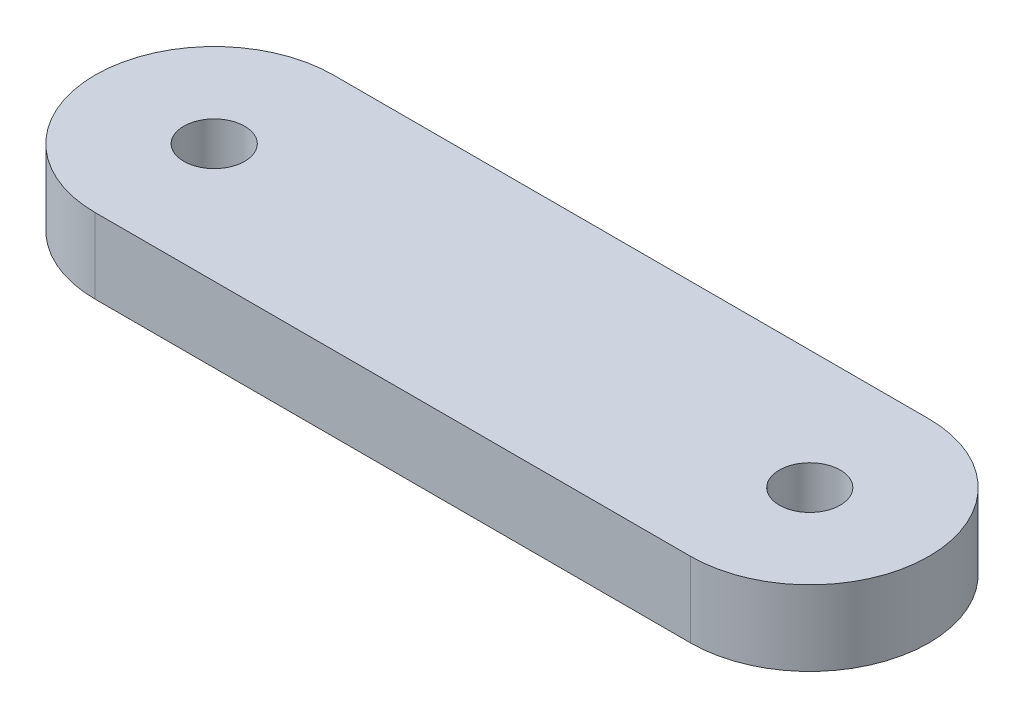
ISO-10303-21;
HEADER;
FILE_DESCRIPTION(('STEP AP214'),'2;1');
FILE_NAME('part.step','',(''),(''),'','','');
FILE_SCHEMA(('AUTOMOTIVE_DESIGN { 1 0 10303 214 1 1 1 1 }'));
ENDSEC;
DATA;
#1=APPLICATION_CONTEXT('core data for automotive mechanical design processes');
#2=APPLICATION_PROTOCOL_DEFINITION('international standard','automotive_design',2000,#1);
#3=PRODUCT_CONTEXT('',#1,'mechanical');
#4=PRODUCT('Part','Part','',(#3));
#5=PRODUCT_RELATED_PRODUCT_CATEGORY('part','',(#4));
#6=PRODUCT_DEFINITION_FORMATION('','',#4);
#7=PRODUCT_DEFINITION_CONTEXT('part definition',#1,'design');
#8=PRODUCT_DEFINITION('design','',#6,#7);
#9=PRODUCT_DEFINITION_SHAPE('','',#8);
#10=(LENGTH_UNIT() NAMED_UNIT(*) SI_UNIT(.MILLI.,.METRE.));
#11=(NAMED_UNIT(*) PLANE_ANGLE_UNIT() SI_UNIT($,.RADIAN.));
#12=(NAMED_UNIT(*) SI_UNIT($,.STERADIAN.) SOLID_ANGLE_UNIT());
#13=UNCERTAINTY_MEASURE_WITH_UNIT(LENGTH_MEASURE(1.E-05),#10,'distance_accuracy_value','');
#14=(GEOMETRIC_REPRESENTATION_CONTEXT(3) GLOBAL_UNCERTAINTY_ASSIGNED_CONTEXT((#13)) GLOBAL_UNIT_ASSIGNED_CONTEXT((#10,
#11,#12)) REPRESENTATION_CONTEXT('',''));
#15=CARTESIAN_POINT('',(0.,0.,0.));
#16=DIRECTION('',(0.,0.,1.));
#17=DIRECTION('',(1.,0.,0.));
#18=AXIS2_PLACEMENT_3D('',#15,#16,#17);
#19=CARTESIAN_POINT('',(13.1315533980582,4.,0.));
#20=DIRECTION('',(0.,1.,0.));
#21=DIRECTION('',(0.,0.,1.));
#22=AXIS2_PLACEMENT_3D('',#19,#20,#21);
#23=PLANE('',#22);
#24=CARTESIAN_POINT('',(-18.6184466019417,4.,0.));
#25=DIRECTION('',(0.,1.,0.));
#26=DIRECTION('',(0.,0.,1.));
#27=AXIS2_PLACEMENT_3D('',#24,#25,#26);
#28=CIRCLE('',#27,1.625);
#29=CARTESIAN_POINT('',(-18.6184466019417,4.,1.625));
#30=VERTEX_POINT('',#29);
#31=EDGE_CURVE('E108',#30,#30,#28,.T.);
#32=ORIENTED_EDGE('',*,*,#31,.F.);
#33=EDGE_LOOP('',(#32));
#34=FACE_BOUND('',#33,.T.);
#35=CARTESIAN_POINT('',(13.1315533980582,4.,0.));
#36=DIRECTION('',(0.,1.,0.));
#37=DIRECTION('',(0.,0.,1.));
#38=AXIS2_PLACEMENT_3D('',#35,#36,#37);
#39=CIRCLE('',#38,6.35);
#40=CARTESIAN_POINT('',(13.1315533980582,4.,6.35));
#41=VERTEX_POINT('',#40);
#42=CARTESIAN_POINT('',(13.1315533980582,4.,-6.35));
#43=VERTEX_POINT('',#42);
#44=EDGE_CURVE('E92',#41,#43,#39,.T.);
#45=ORIENTED_EDGE('',*,*,#44,.T.);
#46=DIRECTION('',(-1.,0.,0.));
#47=VECTOR('',#46,1.);
#48=CARTESIAN_POINT('',(-18.6184466019417,4.,-6.35));
#49=LINE('',#48,#47);
#50=CARTESIAN_POINT('',(-18.6184466019417,4.,-6.35));
#51=VERTEX_POINT('',#50);
#52=EDGE_CURVE('E87',#43,#51,#49,.T.);
#53=ORIENTED_EDGE('',*,*,#52,.T.);
#54=CARTESIAN_POINT('',(-18.6184466019417,4.,0.));
#55=DIRECTION('',(0.,1.,0.));
#56=DIRECTION('',(0.,0.,1.));
#57=AXIS2_PLACEMENT_3D('',#54,#55,#56);
#58=CIRCLE('',#57,6.35);
#59=CARTESIAN_POINT('',(-18.6184466019417,4.,6.35));
#60=VERTEX_POINT('',#59);
#61=EDGE_CURVE('E90',#51,#60,#58,.T.);
#62=ORIENTED_EDGE('',*,*,#61,.T.);
#63=DIRECTION('',(1.,0.,0.));
#64=VECTOR('',#63,1.);
#65=CARTESIAN_POINT('',(-18.6184466019417,4.,6.35));
#66=LINE('',#65,#64);
#67=EDGE_CURVE('E57',#60,#41,#66,.T.);
#68=ORIENTED_EDGE('',*,*,#67,.T.);
#69=EDGE_LOOP('',(#45,#53,#62,#68));
#70=FACE_BOUND('',#69,.T.);
#71=CARTESIAN_POINT('',(13.1315533980582,4.,0.));
#72=DIRECTION('',(0.,1.,0.));
#73=DIRECTION('',(0.,0.,1.));
#74=AXIS2_PLACEMENT_3D('',#71,#72,#73);
#75=CIRCLE('',#74,1.625);
#76=CARTESIAN_POINT('',(13.1315533980582,4.,1.625));
#77=VERTEX_POINT('',#76);
#78=EDGE_CURVE('E124',#77,#77,#75,.T.);
#79=ORIENTED_EDGE('',*,*,#78,.F.);
#80=EDGE_LOOP('',(#79));
#81=FACE_BOUND('',#80,.T.);
#82=ADVANCED_FACE('F40',(#34,#70,#81),#23,.T.);
#83=CARTESIAN_POINT('',(13.1315533980582,0.,0.));
#84=DIRECTION('',(0.,1.,0.));
#85=DIRECTION('',(0.,0.,1.));
#86=AXIS2_PLACEMENT_3D('',#83,#84,#85);
#87=PLANE('',#86);
#88=CARTESIAN_POINT('',(13.1315533980582,0.,0.));
#89=DIRECTION('',(0.,1.,0.));
#90=DIRECTION('',(0.,0.,1.));
#91=AXIS2_PLACEMENT_3D('',#88,#89,#90);
#92=CIRCLE('',#91,6.35);
#93=CARTESIAN_POINT('',(13.1315533980582,0.,6.35));
#94=VERTEX_POINT('',#93);
#95=CARTESIAN_POINT('',(13.1315533980582,0.,-6.35));
#96=VERTEX_POINT('',#95);
#97=EDGE_CURVE('E105',#94,#96,#92,.T.);
#98=ORIENTED_EDGE('',*,*,#97,.F.);
#99=DIRECTION('',(1.,0.,0.));
#100=VECTOR('',#99,1.);
#101=CARTESIAN_POINT('',(-18.6184466019417,0.,6.35));
#102=LINE('',#101,#100);
#103=CARTESIAN_POINT('',(-18.6184466019417,0.,6.35));
#104=VERTEX_POINT('',#103);
#105=EDGE_CURVE('E80',#104,#94,#102,.T.);
#106=ORIENTED_EDGE('',*,*,#105,.F.);
#107=CARTESIAN_POINT('',(-18.6184466019417,0.,0.));
#108=DIRECTION('',(0.,1.,0.));
#109=DIRECTION('',(0.,0.,1.));
#110=AXIS2_PLACEMENT_3D('',#107,#108,#109);
#111=CIRCLE('',#110,6.35);
#112=CARTESIAN_POINT('',(-18.6184466019417,0.,-6.35));
#113=VERTEX_POINT('',#112);
#114=EDGE_CURVE('E74',#113,#104,#111,.T.);
#115=ORIENTED_EDGE('',*,*,#114,.F.);
#116=DIRECTION('',(-1.,0.,0.));
#117=VECTOR('',#116,1.);
#118=CARTESIAN_POINT('',(-18.6184466019417,0.,-6.35));
#119=LINE('',#118,#117);
#120=EDGE_CURVE('E97',#96,#113,#119,.T.);
#121=ORIENTED_EDGE('',*,*,#120,.F.);
#122=EDGE_LOOP('',(#98,#106,#115,#121));
#123=FACE_BOUND('',#122,.T.);
#124=CARTESIAN_POINT('',(-18.6184466019417,0.,0.));
#125=DIRECTION('',(0.,1.,0.));
#126=DIRECTION('',(0.,0.,1.));
#127=AXIS2_PLACEMENT_3D('',#124,#125,#126);
#128=CIRCLE('',#127,1.625);
#129=CARTESIAN_POINT('',(-18.6184466019417,0.,1.625));
#130=VERTEX_POINT('',#129);
#131=EDGE_CURVE('E121',#130,#130,#128,.T.);
#132=ORIENTED_EDGE('',*,*,#131,.T.);
#133=EDGE_LOOP('',(#132));
#134=FACE_BOUND('',#133,.T.);
#135=CARTESIAN_POINT('',(13.1315533980582,0.,0.));
#136=DIRECTION('',(0.,1.,0.));
#137=DIRECTION('',(0.,0.,1.));
#138=AXIS2_PLACEMENT_3D('',#135,#136,#137);
#139=CIRCLE('',#138,1.625);
#140=CARTESIAN_POINT('',(13.1315533980582,0.,1.625));
#141=VERTEX_POINT('',#140);
#142=EDGE_CURVE('E127',#141,#141,#139,.T.);
#143=ORIENTED_EDGE('',*,*,#142,.T.);
#144=EDGE_LOOP('',(#143));
#145=FACE_BOUND('',#144,.T.);
#146=ADVANCED_FACE('F117',(#123,#134,#145),#87,.F.);
#147=CARTESIAN_POINT('',(13.1315533980582,4.,0.));
#148=DIRECTION('',(0.,-1.,0.));
#149=DIRECTION('',(0.,0.,-1.));
#150=AXIS2_PLACEMENT_3D('',#147,#148,#149);
#151=CYLINDRICAL_SURFACE('',#150,6.35);
#152=ORIENTED_EDGE('',*,*,#97,.T.);
#153=DIRECTION('',(0.,-1.,0.));
#154=VECTOR('',#153,1.);
#155=CARTESIAN_POINT('',(13.1315533980582,4.,-6.35));
#156=LINE('',#155,#154);
#157=EDGE_CURVE('E11',#43,#96,#156,.T.);
#158=ORIENTED_EDGE('',*,*,#157,.F.);
#159=ORIENTED_EDGE('',*,*,#44,.F.);
#160=DIRECTION('',(0.,-1.,0.));
#161=VECTOR('',#160,1.);
#162=CARTESIAN_POINT('',(13.1315533980582,4.,6.35));
#163=LINE('',#162,#161);
#164=EDGE_CURVE('E101',#41,#94,#163,.T.);
#165=ORIENTED_EDGE('',*,*,#164,.T.);
#166=EDGE_LOOP('',(#152,#158,#159,#165));
#167=FACE_BOUND('',#166,.T.);
#168=ADVANCED_FACE('F42',(#167),#151,.T.);
#169=CARTESIAN_POINT('',(-18.6184466019417,4.,-6.35));
#170=DIRECTION('',(0.,0.,1.));
#171=DIRECTION('',(1.,0.,0.));
#172=AXIS2_PLACEMENT_3D('',#169,#170,#171);
#173=PLANE('',#172);
#174=ORIENTED_EDGE('',*,*,#120,.T.);
#175=DIRECTION('',(0.,-1.,0.));
#176=VECTOR('',#175,1.);
#177=CARTESIAN_POINT('',(-18.6184466019417,4.,-6.35));
#178=LINE('',#177,#176);
#179=EDGE_CURVE('E49',#51,#113,#178,.T.);
#180=ORIENTED_EDGE('',*,*,#179,.F.);
#181=ORIENTED_EDGE('',*,*,#52,.F.);
#182=ORIENTED_EDGE('',*,*,#157,.T.);
#183=EDGE_LOOP('',(#174,#180,#181,#182));
#184=FACE_BOUND('',#183,.T.);
#185=ADVANCED_FACE('F96',(#184),#173,.F.);
#186=CARTESIAN_POINT('',(-18.6184466019417,4.,0.));
#187=DIRECTION('',(0.,-1.,0.));
#188=DIRECTION('',(0.,0.,-1.));
#189=AXIS2_PLACEMENT_3D('',#186,#187,#188);
#190=CYLINDRICAL_SURFACE('',#189,6.35);
#191=ORIENTED_EDGE('',*,*,#114,.T.);
#192=DIRECTION('',(0.,-1.,0.));
#193=VECTOR('',#192,1.);
#194=CARTESIAN_POINT('',(-18.6184466019417,4.,6.35));
#195=LINE('',#194,#193);
#196=EDGE_CURVE('E98',#60,#104,#195,.T.);
#197=ORIENTED_EDGE('',*,*,#196,.F.);
#198=ORIENTED_EDGE('',*,*,#61,.F.);
#199=ORIENTED_EDGE('',*,*,#179,.T.);
#200=EDGE_LOOP('',(#191,#197,#198,#199));
#201=FACE_BOUND('',#200,.T.);
#202=ADVANCED_FACE('F99',(#201),#190,.T.);
#203=CARTESIAN_POINT('',(-18.6184466019417,4.,6.35));
#204=DIRECTION('',(0.,0.,-1.));
#205=DIRECTION('',(-1.,0.,0.));
#206=AXIS2_PLACEMENT_3D('',#203,#204,#205);
#207=PLANE('',#206);
#208=ORIENTED_EDGE('',*,*,#105,.T.);
#209=ORIENTED_EDGE('',*,*,#164,.F.);
#210=ORIENTED_EDGE('',*,*,#67,.F.);
#211=ORIENTED_EDGE('',*,*,#196,.T.);
#212=EDGE_LOOP('',(#208,#209,#210,#211));
#213=FACE_BOUND('',#212,.T.);
#214=ADVANCED_FACE('F114',(#213),#207,.F.);
#215=CARTESIAN_POINT('',(-18.6184466019417,4.,0.));
#216=DIRECTION('',(0.,-1.,0.));
#217=DIRECTION('',(0.,0.,-1.));
#218=AXIS2_PLACEMENT_3D('',#215,#216,#217);
#219=CYLINDRICAL_SURFACE('',#218,1.625);
#220=ORIENTED_EDGE('',*,*,#31,.T.);
#221=EDGE_LOOP('',(#220));
#222=FACE_BOUND('',#221,.T.);
#223=ORIENTED_EDGE('',*,*,#131,.F.);
#224=EDGE_LOOP('',(#223));
#225=FACE_BOUND('',#224,.T.);
#226=ADVANCED_FACE('F144',(#222,#225),#219,.F.);
#227=CARTESIAN_POINT('',(13.1315533980582,4.,0.));
#228=DIRECTION('',(0.,-1.,0.));
#229=DIRECTION('',(0.,0.,-1.));
#230=AXIS2_PLACEMENT_3D('',#227,#228,#229);
#231=CYLINDRICAL_SURFACE('',#230,1.625);
#232=ORIENTED_EDGE('',*,*,#78,.T.);
#233=EDGE_LOOP('',(#232));
#234=FACE_BOUND('',#233,.T.);
#235=ORIENTED_EDGE('',*,*,#142,.F.);
#236=EDGE_LOOP('',(#235));
#237=FACE_BOUND('',#236,.T.);
#238=ADVANCED_FACE('F133',(#234,#237),#231,.F.);
#239=CLOSED_SHELL('',(#82,#146,#168,#185,#202,#214,#226,#238));
#240=MANIFOLD_SOLID_BREP('B2',#239);
#241=ADVANCED_BREP_SHAPE_REPRESENTATION('',(#18,#240),#14);
#242=SHAPE_DEFINITION_REPRESENTATION(#9,#241);
ENDSEC;
END-ISO-10303-21;
